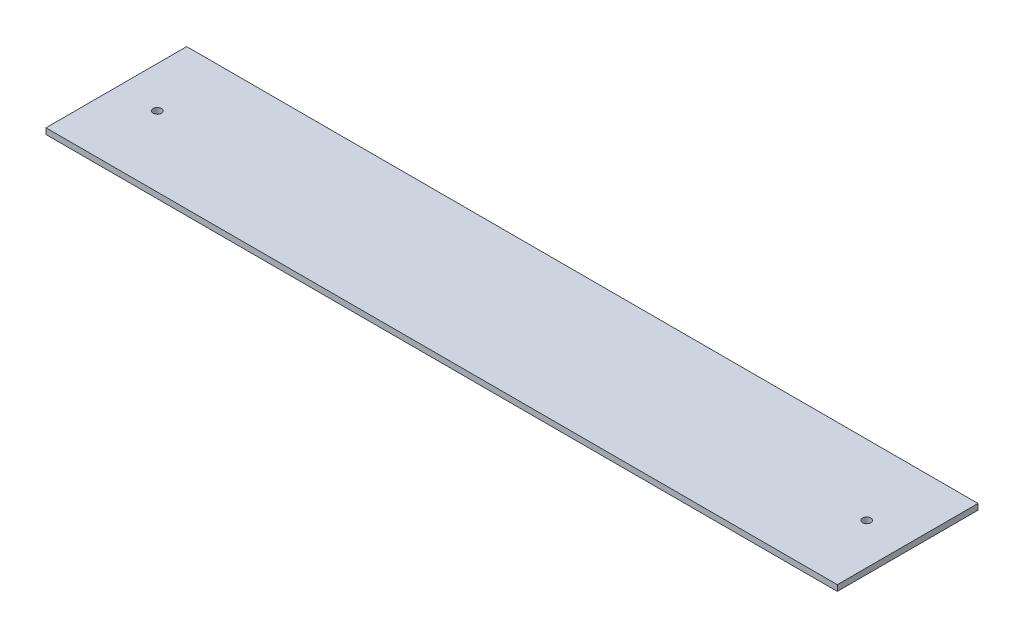
ISO-10303-21;
HEADER;
FILE_DESCRIPTION(('STEP AP214'),'2;1');
FILE_NAME('part.step','',(''),(''),'','','');
FILE_SCHEMA(('AUTOMOTIVE_DESIGN { 1 0 10303 214 1 1 1 1 }'));
ENDSEC;
DATA;
#1=APPLICATION_CONTEXT('core data for automotive mechanical design processes');
#2=APPLICATION_PROTOCOL_DEFINITION('international standard','automotive_design',2000,#1);
#3=PRODUCT_CONTEXT('',#1,'mechanical');
#4=PRODUCT('Part','Part','',(#3));
#5=PRODUCT_RELATED_PRODUCT_CATEGORY('part','',(#4));
#6=PRODUCT_DEFINITION_FORMATION('','',#4);
#7=PRODUCT_DEFINITION_CONTEXT('part definition',#1,'design');
#8=PRODUCT_DEFINITION('design','',#6,#7);
#9=PRODUCT_DEFINITION_SHAPE('','',#8);
#10=(LENGTH_UNIT() NAMED_UNIT(*) SI_UNIT(.MILLI.,.METRE.));
#11=(NAMED_UNIT(*) PLANE_ANGLE_UNIT() SI_UNIT($,.RADIAN.));
#12=(NAMED_UNIT(*) SI_UNIT($,.STERADIAN.) SOLID_ANGLE_UNIT());
#13=UNCERTAINTY_MEASURE_WITH_UNIT(LENGTH_MEASURE(1.E-05),#10,'distance_accuracy_value','');
#14=(GEOMETRIC_REPRESENTATION_CONTEXT(3) GLOBAL_UNCERTAINTY_ASSIGNED_CONTEXT((#13)) GLOBAL_UNIT_ASSIGNED_CONTEXT((#10,
#11,#12)) REPRESENTATION_CONTEXT('',''));
#15=CARTESIAN_POINT('',(0.,0.,0.));
#16=DIRECTION('',(0.,0.,1.));
#17=DIRECTION('',(1.,0.,0.));
#18=AXIS2_PLACEMENT_3D('',#15,#16,#17);
#19=CARTESIAN_POINT('',(-214.312499999999,-3.17499999999954,38.0999999999967));
#20=DIRECTION('',(-1.,0.,0.));
#21=DIRECTION('',(0.,0.,1.));
#22=AXIS2_PLACEMENT_3D('',#19,#20,#21);
#23=PLANE('',#22);
#24=DIRECTION('',(0.,0.,1.));
#25=VECTOR('',#24,1.);
#26=CARTESIAN_POINT('',(-214.312499999999,4.9960036108132E-13,38.1));
#27=LINE('',#26,#25);
#28=CARTESIAN_POINT('',(-214.312499999999,3.83026943495679E-12,-38.1));
#29=VERTEX_POINT('',#28);
#30=CARTESIAN_POINT('',(-214.312499999999,4.9960036108132E-13,38.1));
#31=VERTEX_POINT('',#30);
#32=EDGE_CURVE('E97',#29,#31,#27,.T.);
#33=ORIENTED_EDGE('',*,*,#32,.F.);
#34=DIRECTION('',(0.,1.,0.));
#35=VECTOR('',#34,1.);
#36=CARTESIAN_POINT('',(-214.312499999999,-3.17499999999615,-38.1000000000033));
#37=LINE('',#36,#35);
#38=CARTESIAN_POINT('',(-214.312499999999,-3.17499999999615,-38.1000000000033));
#39=VERTEX_POINT('',#38);
#40=EDGE_CURVE('E11',#39,#29,#37,.T.);
#41=ORIENTED_EDGE('',*,*,#40,.F.);
#42=DIRECTION('',(0.,0.,1.));
#43=VECTOR('',#42,1.);
#44=CARTESIAN_POINT('',(-214.312499999999,-3.17499999999954,38.0999999999967));
#45=LINE('',#44,#43);
#46=CARTESIAN_POINT('',(-214.312499999999,-3.17499999999954,38.0999999999967));
#47=VERTEX_POINT('',#46);
#48=EDGE_CURVE('E90',#39,#47,#45,.T.);
#49=ORIENTED_EDGE('',*,*,#48,.T.);
#50=DIRECTION('',(0.,1.,0.));
#51=VECTOR('',#50,1.);
#52=CARTESIAN_POINT('',(-214.312499999999,-3.17499999999954,38.0999999999967));
#53=LINE('',#52,#51);
#54=EDGE_CURVE('E35',#47,#31,#53,.T.);
#55=ORIENTED_EDGE('',*,*,#54,.T.);
#56=EDGE_LOOP('',(#33,#41,#49,#55));
#57=FACE_BOUND('',#56,.T.);
#58=ADVANCED_FACE('F32',(#57),#23,.T.);
#59=CARTESIAN_POINT('',(214.312500000001,-3.17499999999998,-38.0999999999962));
#60=DIRECTION('',(0.,0.,-1.));
#61=DIRECTION('',(-1.,0.,0.));
#62=AXIS2_PLACEMENT_3D('',#59,#60,#61);
#63=PLANE('',#62);
#64=DIRECTION('',(-1.,0.,0.));
#65=VECTOR('',#64,1.);
#66=CARTESIAN_POINT('',(214.312500000001,0.,-38.1));
#67=LINE('',#66,#65);
#68=CARTESIAN_POINT('',(214.312500000001,0.,-38.1));
#69=VERTEX_POINT('',#68);
#70=EDGE_CURVE('E92',#69,#29,#67,.T.);
#71=ORIENTED_EDGE('',*,*,#70,.F.);
#72=DIRECTION('',(0.,1.,0.));
#73=VECTOR('',#72,1.);
#74=CARTESIAN_POINT('',(214.312500000001,-3.17499999999998,-38.0999999999962));
#75=LINE('',#74,#73);
#76=CARTESIAN_POINT('',(214.312500000001,-3.17499999999998,-38.0999999999962));
#77=VERTEX_POINT('',#76);
#78=EDGE_CURVE('E41',#77,#69,#75,.T.);
#79=ORIENTED_EDGE('',*,*,#78,.F.);
#80=DIRECTION('',(-1.,0.,0.));
#81=VECTOR('',#80,1.);
#82=CARTESIAN_POINT('',(214.312500000001,-3.17499999999998,-38.0999999999962));
#83=LINE('',#82,#81);
#84=EDGE_CURVE('E87',#77,#39,#83,.T.);
#85=ORIENTED_EDGE('',*,*,#84,.T.);
#86=ORIENTED_EDGE('',*,*,#40,.T.);
#87=EDGE_LOOP('',(#71,#79,#85,#86));
#88=FACE_BOUND('',#87,.T.);
#89=ADVANCED_FACE('F108',(#88),#63,.T.);
#90=CARTESIAN_POINT('',(214.312500000001,-3.17499999999998,38.1000000000038));
#91=DIRECTION('',(1.,0.,0.));
#92=DIRECTION('',(0.,0.,-1.));
#93=AXIS2_PLACEMENT_3D('',#90,#91,#92);
#94=PLANE('',#93);
#95=DIRECTION('',(0.,0.,-1.));
#96=VECTOR('',#95,1.);
#97=CARTESIAN_POINT('',(214.312500000001,0.,38.1));
#98=LINE('',#97,#96);
#99=CARTESIAN_POINT('',(214.312500000001,0.,38.1));
#100=VERTEX_POINT('',#99);
#101=EDGE_CURVE('E82',#100,#69,#98,.T.);
#102=ORIENTED_EDGE('',*,*,#101,.F.);
#103=DIRECTION('',(0.,1.,0.));
#104=VECTOR('',#103,1.);
#105=CARTESIAN_POINT('',(214.312500000001,-3.17499999999998,38.1000000000038));
#106=LINE('',#105,#104);
#107=CARTESIAN_POINT('',(214.312500000001,-3.17499999999998,38.1000000000038));
#108=VERTEX_POINT('',#107);
#109=EDGE_CURVE('E77',#108,#100,#106,.T.);
#110=ORIENTED_EDGE('',*,*,#109,.F.);
#111=DIRECTION('',(0.,0.,-1.));
#112=VECTOR('',#111,1.);
#113=CARTESIAN_POINT('',(214.312500000001,-3.17499999999998,38.1000000000038));
#114=LINE('',#113,#112);
#115=EDGE_CURVE('E80',#108,#77,#114,.T.);
#116=ORIENTED_EDGE('',*,*,#115,.T.);
#117=ORIENTED_EDGE('',*,*,#78,.T.);
#118=EDGE_LOOP('',(#102,#110,#116,#117));
#119=FACE_BOUND('',#118,.T.);
#120=ADVANCED_FACE('F79',(#119),#94,.T.);
#121=CARTESIAN_POINT('',(214.312500000001,-3.17499999999998,38.1000000000038));
#122=DIRECTION('',(0.,0.,1.));
#123=DIRECTION('',(1.,0.,0.));
#124=AXIS2_PLACEMENT_3D('',#121,#122,#123);
#125=PLANE('',#124);
#126=DIRECTION('',(1.,0.,0.));
#127=VECTOR('',#126,1.);
#128=CARTESIAN_POINT('',(214.312500000001,0.,38.1));
#129=LINE('',#128,#127);
#130=EDGE_CURVE('E100',#31,#100,#129,.T.);
#131=ORIENTED_EDGE('',*,*,#130,.F.);
#132=ORIENTED_EDGE('',*,*,#54,.F.);
#133=DIRECTION('',(1.,0.,0.));
#134=VECTOR('',#133,1.);
#135=CARTESIAN_POINT('',(214.312500000001,-3.17499999999998,38.1000000000038));
#136=LINE('',#135,#134);
#137=EDGE_CURVE('E86',#47,#108,#136,.T.);
#138=ORIENTED_EDGE('',*,*,#137,.T.);
#139=ORIENTED_EDGE('',*,*,#109,.T.);
#140=EDGE_LOOP('',(#131,#132,#138,#139));
#141=FACE_BOUND('',#140,.T.);
#142=ADVANCED_FACE('F89',(#141),#125,.T.);
#143=CARTESIAN_POINT('',(2.39391839684799E-13,-3.17499999999998,-3.33066907387547E-12));
#144=DIRECTION('',(0.,1.,0.));
#145=DIRECTION('',(0.,0.,1.));
#146=AXIS2_PLACEMENT_3D('',#143,#144,#145);
#147=PLANE('',#146);
#148=CARTESIAN_POINT('',(192.087500000001,-3.17499999999954,-3.33066907387547E-12));
#149=DIRECTION('',(0.,1.,0.));
#150=DIRECTION('',(0.,0.,-1.));
#151=AXIS2_PLACEMENT_3D('',#148,#149,#150);
#152=CIRCLE('',#151,2.25000000000001);
#153=CARTESIAN_POINT('',(192.087500000001,-3.17499999999954,-2.25000000000334));
#154=VERTEX_POINT('',#153);
#155=EDGE_CURVE('E141',#154,#154,#152,.T.);
#156=ORIENTED_EDGE('',*,*,#155,.T.);
#157=EDGE_LOOP('',(#156));
#158=FACE_BOUND('',#157,.T.);
#159=CARTESIAN_POINT('',(-192.087499999999,-3.17499999999998,3.83026943495679E-12));
#160=DIRECTION('',(0.,1.,0.));
#161=DIRECTION('',(0.,0.,1.));
#162=AXIS2_PLACEMENT_3D('',#159,#160,#161);
#163=CIRCLE('',#162,2.25000000000001);
#164=CARTESIAN_POINT('',(-192.087499999999,-3.17499999999998,2.25000000000384));
#165=VERTEX_POINT('',#164);
#166=EDGE_CURVE('E101',#165,#165,#163,.T.);
#167=ORIENTED_EDGE('',*,*,#166,.T.);
#168=EDGE_LOOP('',(#167));
#169=FACE_BOUND('',#168,.T.);
#170=ORIENTED_EDGE('',*,*,#48,.F.);
#171=ORIENTED_EDGE('',*,*,#84,.F.);
#172=ORIENTED_EDGE('',*,*,#115,.F.);
#173=ORIENTED_EDGE('',*,*,#137,.F.);
#174=EDGE_LOOP('',(#170,#171,#172,#173));
#175=FACE_BOUND('',#174,.T.);
#176=ADVANCED_FACE('F85',(#158,#169,#175),#147,.F.);
#177=CARTESIAN_POINT('',(0.,0.,0.));
#178=DIRECTION('',(0.,1.,0.));
#179=DIRECTION('',(0.,0.,1.));
#180=AXIS2_PLACEMENT_3D('',#177,#178,#179);
#181=PLANE('',#180);
#182=CARTESIAN_POINT('',(192.087500000001,4.9960036108132E-13,0.));
#183=DIRECTION('',(0.,1.,0.));
#184=DIRECTION('',(0.,0.,-1.));
#185=AXIS2_PLACEMENT_3D('',#182,#183,#184);
#186=CIRCLE('',#185,2.25000000000001);
#187=CARTESIAN_POINT('',(192.087500000001,4.9960036108132E-13,-2.25000000000006));
#188=VERTEX_POINT('',#187);
#189=EDGE_CURVE('E144',#188,#188,#186,.T.);
#190=ORIENTED_EDGE('',*,*,#189,.F.);
#191=EDGE_LOOP('',(#190));
#192=FACE_BOUND('',#191,.T.);
#193=CARTESIAN_POINT('',(-192.087499999999,0.,0.));
#194=DIRECTION('',(0.,1.,0.));
#195=DIRECTION('',(0.,0.,1.));
#196=AXIS2_PLACEMENT_3D('',#193,#194,#195);
#197=CIRCLE('',#196,2.25000000000001);
#198=CARTESIAN_POINT('',(-192.087499999999,0.,2.25000000000001));
#199=VERTEX_POINT('',#198);
#200=EDGE_CURVE('E146',#199,#199,#197,.T.);
#201=ORIENTED_EDGE('',*,*,#200,.F.);
#202=EDGE_LOOP('',(#201));
#203=FACE_BOUND('',#202,.T.);
#204=ORIENTED_EDGE('',*,*,#32,.T.);
#205=ORIENTED_EDGE('',*,*,#130,.T.);
#206=ORIENTED_EDGE('',*,*,#101,.T.);
#207=ORIENTED_EDGE('',*,*,#70,.T.);
#208=EDGE_LOOP('',(#204,#205,#206,#207));
#209=FACE_BOUND('',#208,.T.);
#210=ADVANCED_FACE('F107',(#192,#203,#209),#181,.T.);
#211=CARTESIAN_POINT('',(-192.087499999999,-3.17499999999998,3.83026943495679E-12));
#212=DIRECTION('',(0.,1.,0.));
#213=DIRECTION('',(0.,0.,1.));
#214=AXIS2_PLACEMENT_3D('',#211,#212,#213);
#215=CYLINDRICAL_SURFACE('',#214,2.25000000000001);
#216=ORIENTED_EDGE('',*,*,#166,.F.);
#217=EDGE_LOOP('',(#216));
#218=FACE_BOUND('',#217,.T.);
#219=ORIENTED_EDGE('',*,*,#200,.T.);
#220=EDGE_LOOP('',(#219));
#221=FACE_BOUND('',#220,.T.);
#222=ADVANCED_FACE('F126',(#218,#221),#215,.F.);
#223=CARTESIAN_POINT('',(192.087500000001,-3.17499999999954,-3.33066907387547E-12));
#224=DIRECTION('',(0.,1.,0.));
#225=DIRECTION('',(0.,0.,1.));
#226=AXIS2_PLACEMENT_3D('',#223,#224,#225);
#227=CYLINDRICAL_SURFACE('',#226,2.25000000000001);
#228=ORIENTED_EDGE('',*,*,#155,.F.);
#229=EDGE_LOOP('',(#228));
#230=FACE_BOUND('',#229,.T.);
#231=ORIENTED_EDGE('',*,*,#189,.T.);
#232=EDGE_LOOP('',(#231));
#233=FACE_BOUND('',#232,.T.);
#234=ADVANCED_FACE('F133',(#230,#233),#227,.F.);
#235=CLOSED_SHELL('',(#58,#89,#120,#142,#176,#210,#222,#234));
#236=MANIFOLD_SOLID_BREP('B2',#235);
#237=ADVANCED_BREP_SHAPE_REPRESENTATION('',(#18,#236),#14);
#238=SHAPE_DEFINITION_REPRESENTATION(#9,#237);
ENDSEC;
END-ISO-10303-21;
